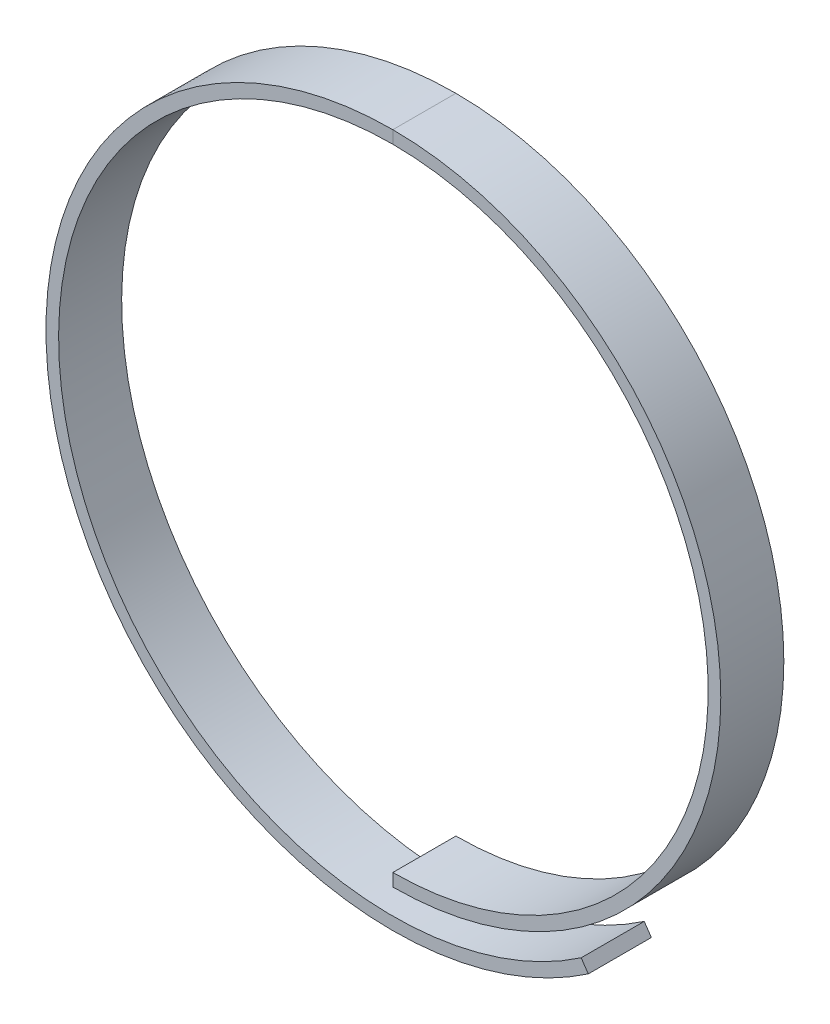
ISO-10303-21;
HEADER;
FILE_DESCRIPTION(('STEP AP214'),'2;1');
FILE_NAME('part.step','',(''),(''),'','','');
FILE_SCHEMA(('AUTOMOTIVE_DESIGN { 1 0 10303 214 1 1 1 1 }'));
ENDSEC;
DATA;
#1=APPLICATION_CONTEXT('core data for automotive mechanical design processes');
#2=APPLICATION_PROTOCOL_DEFINITION('international standard','automotive_design',2000,#1);
#3=PRODUCT_CONTEXT('',#1,'mechanical');
#4=PRODUCT('Part','Part','',(#3));
#5=PRODUCT_RELATED_PRODUCT_CATEGORY('part','',(#4));
#6=PRODUCT_DEFINITION_FORMATION('','',#4);
#7=PRODUCT_DEFINITION_CONTEXT('part definition',#1,'design');
#8=PRODUCT_DEFINITION('design','',#6,#7);
#9=PRODUCT_DEFINITION_SHAPE('','',#8);
#10=(LENGTH_UNIT() NAMED_UNIT(*) SI_UNIT(.MILLI.,.METRE.));
#11=(NAMED_UNIT(*) PLANE_ANGLE_UNIT() SI_UNIT($,.RADIAN.));
#12=(NAMED_UNIT(*) SI_UNIT($,.STERADIAN.) SOLID_ANGLE_UNIT());
#13=UNCERTAINTY_MEASURE_WITH_UNIT(LENGTH_MEASURE(1.E-05),#10,'distance_accuracy_value','');
#14=(GEOMETRIC_REPRESENTATION_CONTEXT(3) GLOBAL_UNCERTAINTY_ASSIGNED_CONTEXT((#13)) GLOBAL_UNIT_ASSIGNED_CONTEXT((#10,
#11,#12)) REPRESENTATION_CONTEXT('',''));
#15=CARTESIAN_POINT('',(0.,0.,0.));
#16=DIRECTION('',(0.,0.,1.));
#17=DIRECTION('',(1.,0.,0.));
#18=AXIS2_PLACEMENT_3D('',#15,#16,#17);
#19=CARTESIAN_POINT('',(0.,55.,10.));
#20=DIRECTION('',(0.,0.,1.));
#21=DIRECTION('',(1.,0.,0.));
#22=AXIS2_PLACEMENT_3D('',#19,#20,#21);
#23=PLANE('',#22);
#24=DIRECTION('',(0.,-1.,0.));
#25=VECTOR('',#24,1.);
#26=CARTESIAN_POINT('',(0.,55.,10.));
#27=LINE('',#26,#25);
#28=CARTESIAN_POINT('',(0.,55.,10.));
#29=VERTEX_POINT('',#28);
#30=CARTESIAN_POINT('',(0.,53.,10.));
#31=VERTEX_POINT('',#30);
#32=EDGE_CURVE('E11',#29,#31,#27,.T.);
#33=ORIENTED_EDGE('',*,*,#32,.F.);
#34=CARTESIAN_POINT('',(0.,0.,10.));
#35=DIRECTION('',(0.,0.,1.));
#36=DIRECTION('',(1.,0.,0.));
#37=AXIS2_PLACEMENT_3D('',#34,#35,#36);
#38=CIRCLE('',#37,55.);
#39=CARTESIAN_POINT('',(30.9916035042794,-45.4369949736285,10.));
#40=VERTEX_POINT('',#39);
#41=EDGE_CURVE('E88',#29,#40,#38,.T.);
#42=ORIENTED_EDGE('',*,*,#41,.T.);
#43=DIRECTION('',(0.563483700077807,-0.826127181338699,0.));
#44=VECTOR('',#43,1.);
#45=CARTESIAN_POINT('',(29.8646361041237,-43.7847406109511,10.));
#46=LINE('',#45,#44);
#47=CARTESIAN_POINT('',(29.8646361041237,-43.7847406109511,10.));
#48=VERTEX_POINT('',#47);
#49=EDGE_CURVE('E149',#48,#40,#46,.T.);
#50=ORIENTED_EDGE('',*,*,#49,.F.);
#51=CARTESIAN_POINT('',(0.,0.,10.));
#52=DIRECTION('',(0.,0.,1.));
#53=DIRECTION('',(1.,0.,0.));
#54=AXIS2_PLACEMENT_3D('',#51,#52,#53);
#55=CIRCLE('',#54,53.);
#56=EDGE_CURVE('E115',#31,#48,#55,.T.);
#57=ORIENTED_EDGE('',*,*,#56,.F.);
#58=EDGE_LOOP('',(#33,#42,#50,#57));
#59=FACE_BOUND('',#58,.T.);
#60=ADVANCED_FACE('F41',(#59),#23,.T.);
#61=CARTESIAN_POINT('',(0.,53.,0.));
#62=DIRECTION('',(0.,0.,-1.));
#63=DIRECTION('',(-1.,0.,0.));
#64=AXIS2_PLACEMENT_3D('',#61,#62,#63);
#65=PLANE('',#64);
#66=DIRECTION('',(0.,1.,0.));
#67=VECTOR('',#66,1.);
#68=CARTESIAN_POINT('',(0.,53.,0.));
#69=LINE('',#68,#67);
#70=CARTESIAN_POINT('',(0.,53.,0.));
#71=VERTEX_POINT('',#70);
#72=CARTESIAN_POINT('',(0.,55.,0.));
#73=VERTEX_POINT('',#72);
#74=EDGE_CURVE('E49',#71,#73,#69,.T.);
#75=ORIENTED_EDGE('',*,*,#74,.F.);
#76=CARTESIAN_POINT('',(0.,0.,0.));
#77=DIRECTION('',(0.,0.,1.));
#78=DIRECTION('',(1.,0.,0.));
#79=AXIS2_PLACEMENT_3D('',#76,#77,#78);
#80=CIRCLE('',#79,53.);
#81=CARTESIAN_POINT('',(29.8646361041237,-43.7847406109511,0.));
#82=VERTEX_POINT('',#81);
#83=EDGE_CURVE('E130',#71,#82,#80,.T.);
#84=ORIENTED_EDGE('',*,*,#83,.T.);
#85=DIRECTION('',(0.563483700077807,-0.826127181338699,0.));
#86=VECTOR('',#85,1.);
#87=CARTESIAN_POINT('',(29.8646361041237,-43.7847406109511,0.));
#88=LINE('',#87,#86);
#89=CARTESIAN_POINT('',(30.9916035042794,-45.4369949736285,0.));
#90=VERTEX_POINT('',#89);
#91=EDGE_CURVE('E127',#82,#90,#88,.T.);
#92=ORIENTED_EDGE('',*,*,#91,.T.);
#93=CARTESIAN_POINT('',(0.,0.,0.));
#94=DIRECTION('',(0.,0.,1.));
#95=DIRECTION('',(1.,0.,0.));
#96=AXIS2_PLACEMENT_3D('',#93,#94,#95);
#97=CIRCLE('',#96,55.);
#98=EDGE_CURVE('E124',#73,#90,#97,.T.);
#99=ORIENTED_EDGE('',*,*,#98,.F.);
#100=EDGE_LOOP('',(#75,#84,#92,#99));
#101=FACE_BOUND('',#100,.T.);
#102=ADVANCED_FACE('F155',(#101),#65,.T.);
#103=CARTESIAN_POINT('',(0.,0.,10.));
#104=DIRECTION('',(0.,0.,-1.));
#105=DIRECTION('',(-1.,0.,0.));
#106=AXIS2_PLACEMENT_3D('',#103,#104,#105);
#107=CYLINDRICAL_SURFACE('',#106,55.);
#108=ORIENTED_EDGE('',*,*,#98,.T.);
#109=DIRECTION('',(0.,0.,-1.));
#110=VECTOR('',#109,1.);
#111=CARTESIAN_POINT('',(30.9916035042794,-45.4369949736285,10.));
#112=LINE('',#111,#110);
#113=EDGE_CURVE('E144',#40,#90,#112,.T.);
#114=ORIENTED_EDGE('',*,*,#113,.F.);
#115=ORIENTED_EDGE('',*,*,#41,.F.);
#116=DIRECTION('',(0.,0.,-1.));
#117=VECTOR('',#116,1.);
#118=CARTESIAN_POINT('',(0.,55.,10.));
#119=LINE('',#118,#117);
#120=EDGE_CURVE('E120',#29,#73,#119,.T.);
#121=ORIENTED_EDGE('',*,*,#120,.T.);
#122=EDGE_LOOP('',(#108,#114,#115,#121));
#123=FACE_BOUND('',#122,.T.);
#124=ADVANCED_FACE('F152',(#123),#107,.T.);
#125=CARTESIAN_POINT('',(29.8646361041237,-43.7847406109511,10.));
#126=DIRECTION('',(0.826127181338699,0.563483700077807,0.));
#127=DIRECTION('',(-0.563483700077807,0.826127181338699,0.));
#128=AXIS2_PLACEMENT_3D('',#125,#126,#127);
#129=PLANE('',#128);
#130=ORIENTED_EDGE('',*,*,#91,.F.);
#131=DIRECTION('',(0.,0.,-1.));
#132=VECTOR('',#131,1.);
#133=CARTESIAN_POINT('',(29.8646361041237,-43.7847406109511,10.));
#134=LINE('',#133,#132);
#135=EDGE_CURVE('E142',#48,#82,#134,.T.);
#136=ORIENTED_EDGE('',*,*,#135,.F.);
#137=ORIENTED_EDGE('',*,*,#49,.T.);
#138=ORIENTED_EDGE('',*,*,#113,.T.);
#139=EDGE_LOOP('',(#130,#136,#137,#138));
#140=FACE_BOUND('',#139,.T.);
#141=ADVANCED_FACE('F148',(#140),#129,.T.);
#142=CARTESIAN_POINT('',(0.,0.,10.));
#143=DIRECTION('',(0.,0.,-1.));
#144=DIRECTION('',(-1.,0.,0.));
#145=AXIS2_PLACEMENT_3D('',#142,#143,#144);
#146=CYLINDRICAL_SURFACE('',#145,53.);
#147=ORIENTED_EDGE('',*,*,#83,.F.);
#148=DIRECTION('',(0.,0.,-1.));
#149=VECTOR('',#148,1.);
#150=CARTESIAN_POINT('',(0.,53.,10.));
#151=LINE('',#150,#149);
#152=EDGE_CURVE('E108',#31,#71,#151,.T.);
#153=ORIENTED_EDGE('',*,*,#152,.F.);
#154=ORIENTED_EDGE('',*,*,#56,.T.);
#155=ORIENTED_EDGE('',*,*,#135,.T.);
#156=EDGE_LOOP('',(#147,#153,#154,#155));
#157=FACE_BOUND('',#156,.T.);
#158=ADVANCED_FACE('F158',(#157),#146,.F.);
#159=CARTESIAN_POINT('',(0.,3.,10.));
#160=DIRECTION('',(0.,0.,-1.));
#161=DIRECTION('',(-1.,0.,0.));
#162=AXIS2_PLACEMENT_3D('',#159,#160,#161);
#163=CYLINDRICAL_SURFACE('',#162,50.);
#164=CARTESIAN_POINT('',(0.,3.,0.));
#165=DIRECTION('',(0.,0.,1.));
#166=DIRECTION('',(1.,0.,0.));
#167=AXIS2_PLACEMENT_3D('',#164,#165,#166);
#168=CIRCLE('',#167,50.);
#169=CARTESIAN_POINT('',(0.,-47.,0.));
#170=VERTEX_POINT('',#169);
#171=EDGE_CURVE('E103',#170,#71,#168,.T.);
#172=ORIENTED_EDGE('',*,*,#171,.F.);
#173=DIRECTION('',(0.,0.,-1.));
#174=VECTOR('',#173,1.);
#175=CARTESIAN_POINT('',(0.,-47.,10.));
#176=LINE('',#175,#174);
#177=CARTESIAN_POINT('',(0.,-47.,10.));
#178=VERTEX_POINT('',#177);
#179=EDGE_CURVE('E98',#178,#170,#176,.T.);
#180=ORIENTED_EDGE('',*,*,#179,.F.);
#181=CARTESIAN_POINT('',(0.,3.,10.));
#182=DIRECTION('',(0.,0.,1.));
#183=DIRECTION('',(1.,0.,0.));
#184=AXIS2_PLACEMENT_3D('',#181,#182,#183);
#185=CIRCLE('',#184,50.);
#186=EDGE_CURVE('E102',#178,#31,#185,.T.);
#187=ORIENTED_EDGE('',*,*,#186,.T.);
#188=ORIENTED_EDGE('',*,*,#152,.T.);
#189=EDGE_LOOP('',(#172,#180,#187,#188));
#190=FACE_BOUND('',#189,.T.);
#191=ADVANCED_FACE('F100',(#190),#163,.F.);
#192=CARTESIAN_POINT('',(0.,-49.,10.));
#193=DIRECTION('',(-1.,0.,0.));
#194=DIRECTION('',(0.,-1.,0.));
#195=AXIS2_PLACEMENT_3D('',#192,#193,#194);
#196=PLANE('',#195);
#197=DIRECTION('',(0.,1.,0.));
#198=VECTOR('',#197,1.);
#199=CARTESIAN_POINT('',(0.,-49.,0.));
#200=LINE('',#199,#198);
#201=CARTESIAN_POINT('',(0.,-49.,0.));
#202=VERTEX_POINT('',#201);
#203=EDGE_CURVE('E134',#202,#170,#200,.T.);
#204=ORIENTED_EDGE('',*,*,#203,.F.);
#205=DIRECTION('',(0.,0.,-1.));
#206=VECTOR('',#205,1.);
#207=CARTESIAN_POINT('',(0.,-49.,10.));
#208=LINE('',#207,#206);
#209=CARTESIAN_POINT('',(0.,-49.,10.));
#210=VERTEX_POINT('',#209);
#211=EDGE_CURVE('E78',#210,#202,#208,.T.);
#212=ORIENTED_EDGE('',*,*,#211,.F.);
#213=DIRECTION('',(0.,1.,0.));
#214=VECTOR('',#213,1.);
#215=CARTESIAN_POINT('',(0.,-49.,10.));
#216=LINE('',#215,#214);
#217=EDGE_CURVE('E113',#210,#178,#216,.T.);
#218=ORIENTED_EDGE('',*,*,#217,.T.);
#219=ORIENTED_EDGE('',*,*,#179,.T.);
#220=EDGE_LOOP('',(#204,#212,#218,#219));
#221=FACE_BOUND('',#220,.T.);
#222=ADVANCED_FACE('F117',(#221),#196,.T.);
#223=CARTESIAN_POINT('',(0.,3.,10.));
#224=DIRECTION('',(0.,0.,-1.));
#225=DIRECTION('',(-1.,0.,0.));
#226=AXIS2_PLACEMENT_3D('',#223,#224,#225);
#227=CYLINDRICAL_SURFACE('',#226,52.);
#228=CARTESIAN_POINT('',(0.,3.,0.));
#229=DIRECTION('',(0.,0.,1.));
#230=DIRECTION('',(1.,0.,0.));
#231=AXIS2_PLACEMENT_3D('',#228,#229,#230);
#232=CIRCLE('',#231,52.);
#233=EDGE_CURVE('E136',#202,#73,#232,.T.);
#234=ORIENTED_EDGE('',*,*,#233,.T.);
#235=ORIENTED_EDGE('',*,*,#120,.F.);
#236=CARTESIAN_POINT('',(0.,3.,10.));
#237=DIRECTION('',(0.,0.,1.));
#238=DIRECTION('',(1.,0.,0.));
#239=AXIS2_PLACEMENT_3D('',#236,#237,#238);
#240=CIRCLE('',#239,52.);
#241=EDGE_CURVE('E118',#210,#29,#240,.T.);
#242=ORIENTED_EDGE('',*,*,#241,.F.);
#243=ORIENTED_EDGE('',*,*,#211,.T.);
#244=EDGE_LOOP('',(#234,#235,#242,#243));
#245=FACE_BOUND('',#244,.T.);
#246=ADVANCED_FACE('F161',(#245),#227,.T.);
#247=CARTESIAN_POINT('',(0.,0.,10.));
#248=DIRECTION('',(0.,0.,1.));
#249=DIRECTION('',(1.,0.,0.));
#250=AXIS2_PLACEMENT_3D('',#247,#248,#249);
#251=PLANE('',#250);
#252=ORIENTED_EDGE('',*,*,#241,.T.);
#253=ORIENTED_EDGE('',*,*,#32,.T.);
#254=ORIENTED_EDGE('',*,*,#186,.F.);
#255=ORIENTED_EDGE('',*,*,#217,.F.);
#256=EDGE_LOOP('',(#252,#253,#254,#255));
#257=FACE_BOUND('',#256,.T.);
#258=ADVANCED_FACE('F112',(#257),#251,.T.);
#259=CARTESIAN_POINT('',(0.,0.,0.));
#260=DIRECTION('',(0.,0.,1.));
#261=DIRECTION('',(1.,0.,0.));
#262=AXIS2_PLACEMENT_3D('',#259,#260,#261);
#263=PLANE('',#262);
#264=ORIENTED_EDGE('',*,*,#171,.T.);
#265=ORIENTED_EDGE('',*,*,#74,.T.);
#266=ORIENTED_EDGE('',*,*,#233,.F.);
#267=ORIENTED_EDGE('',*,*,#203,.T.);
#268=EDGE_LOOP('',(#264,#265,#266,#267));
#269=FACE_BOUND('',#268,.T.);
#270=ADVANCED_FACE('F160',(#269),#263,.F.);
#271=CLOSED_SHELL('',(#60,#102,#124,#141,#158,#191,#222,#246,#258,#270));
#272=MANIFOLD_SOLID_BREP('B2',#271);
#273=ADVANCED_BREP_SHAPE_REPRESENTATION('',(#18,#272),#14);
#274=SHAPE_DEFINITION_REPRESENTATION(#9,#273);
ENDSEC;
END-ISO-10303-21;
